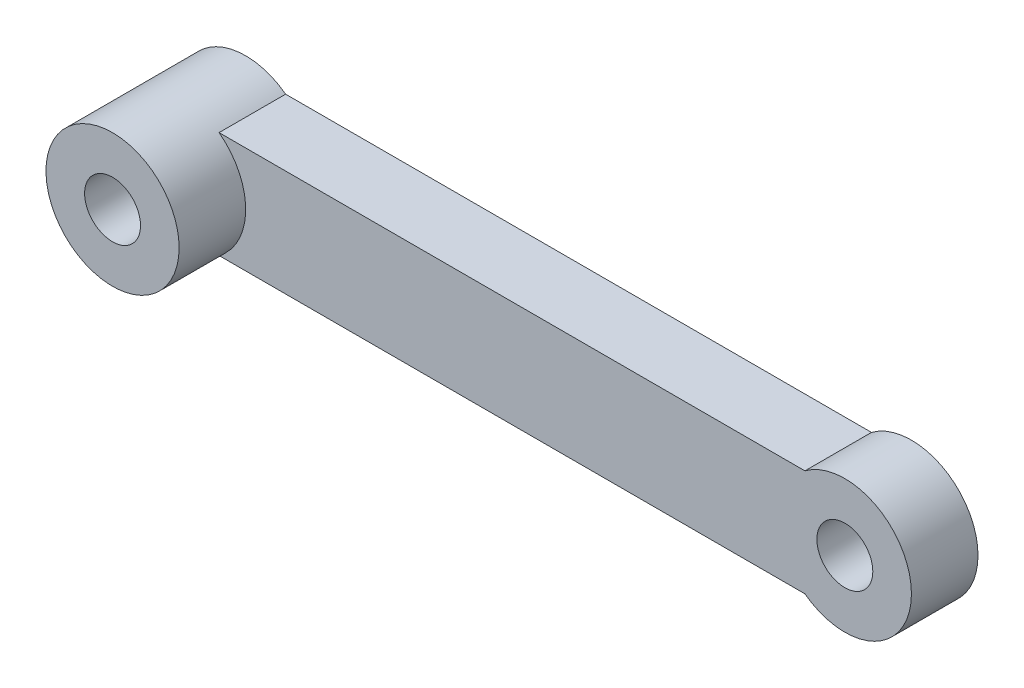
ISO-10303-21;
HEADER;
FILE_DESCRIPTION(('STEP AP214'),'2;1');
FILE_NAME('part.step','',(''),(''),'','','');
FILE_SCHEMA(('AUTOMOTIVE_DESIGN { 1 0 10303 214 1 1 1 1 }'));
ENDSEC;
DATA;
#1=APPLICATION_CONTEXT('core data for automotive mechanical design processes');
#2=APPLICATION_PROTOCOL_DEFINITION('international standard','automotive_design',2000,#1);
#3=PRODUCT_CONTEXT('',#1,'mechanical');
#4=PRODUCT('Part','Part','',(#3));
#5=PRODUCT_RELATED_PRODUCT_CATEGORY('part','',(#4));
#6=PRODUCT_DEFINITION_FORMATION('','',#4);
#7=PRODUCT_DEFINITION_CONTEXT('part definition',#1,'design');
#8=PRODUCT_DEFINITION('design','',#6,#7);
#9=PRODUCT_DEFINITION_SHAPE('','',#8);
#10=(LENGTH_UNIT() NAMED_UNIT(*) SI_UNIT(.MILLI.,.METRE.));
#11=(NAMED_UNIT(*) PLANE_ANGLE_UNIT() SI_UNIT($,.RADIAN.));
#12=(NAMED_UNIT(*) SI_UNIT($,.STERADIAN.) SOLID_ANGLE_UNIT());
#13=UNCERTAINTY_MEASURE_WITH_UNIT(LENGTH_MEASURE(1.E-05),#10,'distance_accuracy_value','');
#14=(GEOMETRIC_REPRESENTATION_CONTEXT(3) GLOBAL_UNCERTAINTY_ASSIGNED_CONTEXT((#13)) GLOBAL_UNIT_ASSIGNED_CONTEXT((#10,
#11,#12)) REPRESENTATION_CONTEXT('',''));
#15=CARTESIAN_POINT('',(0.,0.,0.));
#16=DIRECTION('',(0.,0.,1.));
#17=DIRECTION('',(1.,0.,0.));
#18=AXIS2_PLACEMENT_3D('',#15,#16,#17);
#19=CARTESIAN_POINT('',(-43.0216580109235,-1.7639320225002,5.));
#20=DIRECTION('',(0.,0.,-1.));
#21=DIRECTION('',(-1.,0.,0.));
#22=AXIS2_PLACEMENT_3D('',#19,#20,#21);
#23=CYLINDRICAL_SURFACE('',#22,5.);
#24=CARTESIAN_POINT('',(-43.0216580109235,-1.7639320225002,0.));
#25=DIRECTION('',(0.,0.,1.));
#26=DIRECTION('',(1.,0.,0.));
#27=AXIS2_PLACEMENT_3D('',#24,#25,#26);
#28=CIRCLE('',#27,5.);
#29=CARTESIAN_POINT('',(-40.0216580109235,2.23606797749981,0.));
#30=VERTEX_POINT('',#29);
#31=CARTESIAN_POINT('',(-40.0216580109235,-5.7639320225002,0.));
#32=VERTEX_POINT('',#31);
#33=EDGE_CURVE('E108',#30,#32,#28,.T.);
#34=ORIENTED_EDGE('',*,*,#33,.T.);
#35=DIRECTION('',(0.,0.,-1.));
#36=VECTOR('',#35,1.);
#37=CARTESIAN_POINT('',(-40.0216580109235,-5.7639320225002,5.));
#38=LINE('',#37,#36);
#39=CARTESIAN_POINT('',(-40.0216580109235,-5.7639320225002,5.));
#40=VERTEX_POINT('',#39);
#41=EDGE_CURVE('E51',#40,#32,#38,.T.);
#42=ORIENTED_EDGE('',*,*,#41,.F.);
#43=CARTESIAN_POINT('',(-43.0216580109235,-1.7639320225002,5.));
#44=DIRECTION('',(0.,0.,1.));
#45=DIRECTION('',(1.,0.,0.));
#46=AXIS2_PLACEMENT_3D('',#43,#44,#45);
#47=CIRCLE('',#46,5.);
#48=CARTESIAN_POINT('',(-40.0216580109235,2.23606797749981,5.));
#49=VERTEX_POINT('',#48);
#50=EDGE_CURVE('E11',#40,#49,#47,.T.);
#51=ORIENTED_EDGE('',*,*,#50,.T.);
#52=DIRECTION('',(0.,0.,-1.));
#53=VECTOR('',#52,1.);
#54=CARTESIAN_POINT('',(-40.0216580109235,2.23606797749981,5.));
#55=LINE('',#54,#53);
#56=EDGE_CURVE('E89',#49,#30,#55,.T.);
#57=ORIENTED_EDGE('',*,*,#56,.T.);
#58=EDGE_LOOP('',(#34,#42,#51,#57));
#59=FACE_BOUND('',#58,.T.);
#60=CARTESIAN_POINT('',(-43.0216580109235,-1.7639320225002,10.));
#61=DIRECTION('',(0.,0.,1.));
#62=DIRECTION('',(1.,0.,0.));
#63=AXIS2_PLACEMENT_3D('',#60,#61,#62);
#64=CIRCLE('',#63,5.);
#65=CARTESIAN_POINT('',(-38.0216580109235,-1.7639320225002,10.));
#66=VERTEX_POINT('',#65);
#67=EDGE_CURVE('E139',#66,#66,#64,.T.);
#68=ORIENTED_EDGE('',*,*,#67,.F.);
#69=EDGE_LOOP('',(#68));
#70=FACE_BOUND('',#69,.T.);
#71=ADVANCED_FACE('F47',(#59,#70),#23,.T.);
#72=CARTESIAN_POINT('',(0.,-5.7639320225002,5.));
#73=DIRECTION('',(0.,1.,0.));
#74=DIRECTION('',(-1.,0.,0.));
#75=AXIS2_PLACEMENT_3D('',#72,#73,#74);
#76=PLANE('',#75);
#77=DIRECTION('',(1.,0.,0.));
#78=VECTOR('',#77,1.);
#79=CARTESIAN_POINT('',(0.,-5.7639320225002,0.));
#80=LINE('',#79,#78);
#81=CARTESIAN_POINT('',(3.97834198907648,-5.7639320225002,0.));
#82=VERTEX_POINT('',#81);
#83=EDGE_CURVE('E130',#32,#82,#80,.T.);
#84=ORIENTED_EDGE('',*,*,#83,.T.);
#85=DIRECTION('',(0.,0.,-1.));
#86=VECTOR('',#85,1.);
#87=CARTESIAN_POINT('',(3.97834198907648,-5.7639320225002,5.));
#88=LINE('',#87,#86);
#89=CARTESIAN_POINT('',(3.97834198907648,-5.7639320225002,5.));
#90=VERTEX_POINT('',#89);
#91=EDGE_CURVE('E111',#90,#82,#88,.T.);
#92=ORIENTED_EDGE('',*,*,#91,.F.);
#93=DIRECTION('',(1.,0.,0.));
#94=VECTOR('',#93,1.);
#95=CARTESIAN_POINT('',(0.,-5.7639320225002,5.));
#96=LINE('',#95,#94);
#97=EDGE_CURVE('E124',#40,#90,#96,.T.);
#98=ORIENTED_EDGE('',*,*,#97,.F.);
#99=ORIENTED_EDGE('',*,*,#41,.T.);
#100=EDGE_LOOP('',(#84,#92,#98,#99));
#101=FACE_BOUND('',#100,.T.);
#102=ADVANCED_FACE('F169',(#101),#76,.F.);
#103=CARTESIAN_POINT('',(6.97834198907648,-1.7639320225002,5.));
#104=DIRECTION('',(0.,0.,-1.));
#105=DIRECTION('',(-1.,0.,0.));
#106=AXIS2_PLACEMENT_3D('',#103,#104,#105);
#107=CYLINDRICAL_SURFACE('',#106,5.);
#108=CARTESIAN_POINT('',(6.97834198907648,-1.7639320225002,0.));
#109=DIRECTION('',(0.,0.,1.));
#110=DIRECTION('',(1.,0.,0.));
#111=AXIS2_PLACEMENT_3D('',#108,#109,#110);
#112=CIRCLE('',#111,5.);
#113=CARTESIAN_POINT('',(3.97834198907648,2.23606797749981,0.));
#114=VERTEX_POINT('',#113);
#115=EDGE_CURVE('E127',#82,#114,#112,.T.);
#116=ORIENTED_EDGE('',*,*,#115,.T.);
#117=DIRECTION('',(0.,0.,-1.));
#118=VECTOR('',#117,1.);
#119=CARTESIAN_POINT('',(3.97834198907648,2.23606797749981,5.));
#120=LINE('',#119,#118);
#121=CARTESIAN_POINT('',(3.97834198907648,2.23606797749981,5.));
#122=VERTEX_POINT('',#121);
#123=EDGE_CURVE('E83',#122,#114,#120,.T.);
#124=ORIENTED_EDGE('',*,*,#123,.F.);
#125=CARTESIAN_POINT('',(6.97834198907648,-1.7639320225002,5.));
#126=DIRECTION('',(0.,0.,1.));
#127=DIRECTION('',(1.,0.,0.));
#128=AXIS2_PLACEMENT_3D('',#125,#126,#127);
#129=CIRCLE('',#128,5.);
#130=EDGE_CURVE('E66',#90,#122,#129,.T.);
#131=ORIENTED_EDGE('',*,*,#130,.F.);
#132=ORIENTED_EDGE('',*,*,#91,.T.);
#133=EDGE_LOOP('',(#116,#124,#131,#132));
#134=FACE_BOUND('',#133,.T.);
#135=ADVANCED_FACE('F173',(#134),#107,.T.);
#136=CARTESIAN_POINT('',(0.,2.23606797749981,5.));
#137=DIRECTION('',(0.,1.,0.));
#138=DIRECTION('',(-1.,0.,0.));
#139=AXIS2_PLACEMENT_3D('',#136,#137,#138);
#140=PLANE('',#139);
#141=DIRECTION('',(1.,0.,0.));
#142=VECTOR('',#141,1.);
#143=CARTESIAN_POINT('',(0.,2.23606797749981,0.));
#144=LINE('',#143,#142);
#145=EDGE_CURVE('E102',#30,#114,#144,.T.);
#146=ORIENTED_EDGE('',*,*,#145,.F.);
#147=ORIENTED_EDGE('',*,*,#56,.F.);
#148=DIRECTION('',(1.,0.,0.));
#149=VECTOR('',#148,1.);
#150=CARTESIAN_POINT('',(0.,2.23606797749981,5.));
#151=LINE('',#150,#149);
#152=EDGE_CURVE('E94',#49,#122,#151,.T.);
#153=ORIENTED_EDGE('',*,*,#152,.T.);
#154=ORIENTED_EDGE('',*,*,#123,.T.);
#155=EDGE_LOOP('',(#146,#147,#153,#154));
#156=FACE_BOUND('',#155,.T.);
#157=ADVANCED_FACE('F100',(#156),#140,.T.);
#158=CARTESIAN_POINT('',(-43.0216580109235,-1.7639320225002,5.));
#159=DIRECTION('',(0.,0.,-1.));
#160=DIRECTION('',(-1.,0.,0.));
#161=AXIS2_PLACEMENT_3D('',#158,#159,#160);
#162=CYLINDRICAL_SURFACE('',#161,2.1);
#163=CARTESIAN_POINT('',(-43.0216580109235,-1.7639320225002,0.));
#164=DIRECTION('',(0.,0.,1.));
#165=DIRECTION('',(1.,0.,0.));
#166=AXIS2_PLACEMENT_3D('',#163,#164,#165);
#167=CIRCLE('',#166,2.1);
#168=CARTESIAN_POINT('',(-40.9216580109235,-1.7639320225002,0.));
#169=VERTEX_POINT('',#168);
#170=EDGE_CURVE('E135',#169,#169,#167,.T.);
#171=ORIENTED_EDGE('',*,*,#170,.F.);
#172=EDGE_LOOP('',(#171));
#173=FACE_BOUND('',#172,.T.);
#174=CARTESIAN_POINT('',(-43.0216580109235,-1.7639320225002,10.));
#175=DIRECTION('',(0.,0.,1.));
#176=DIRECTION('',(1.,0.,0.));
#177=AXIS2_PLACEMENT_3D('',#174,#175,#176);
#178=CIRCLE('',#177,2.1);
#179=CARTESIAN_POINT('',(-40.9216580109235,-1.7639320225002,10.));
#180=VERTEX_POINT('',#179);
#181=EDGE_CURVE('E150',#180,#180,#178,.T.);
#182=ORIENTED_EDGE('',*,*,#181,.T.);
#183=EDGE_LOOP('',(#182));
#184=FACE_BOUND('',#183,.T.);
#185=ADVANCED_FACE('F49',(#173,#184),#162,.F.);
#186=CARTESIAN_POINT('',(6.97834198907648,-1.7639320225002,5.));
#187=DIRECTION('',(0.,0.,-1.));
#188=DIRECTION('',(-1.,0.,0.));
#189=AXIS2_PLACEMENT_3D('',#186,#187,#188);
#190=CYLINDRICAL_SURFACE('',#189,2.1);
#191=CARTESIAN_POINT('',(6.97834198907648,-1.7639320225002,5.));
#192=DIRECTION('',(0.,0.,1.));
#193=DIRECTION('',(1.,0.,0.));
#194=AXIS2_PLACEMENT_3D('',#191,#192,#193);
#195=CIRCLE('',#194,2.1);
#196=CARTESIAN_POINT('',(9.07834198907648,-1.7639320225002,5.));
#197=VERTEX_POINT('',#196);
#198=EDGE_CURVE('E98',#197,#197,#195,.T.);
#199=ORIENTED_EDGE('',*,*,#198,.T.);
#200=EDGE_LOOP('',(#199));
#201=FACE_BOUND('',#200,.T.);
#202=CARTESIAN_POINT('',(6.97834198907648,-1.7639320225002,0.));
#203=DIRECTION('',(0.,0.,1.));
#204=DIRECTION('',(1.,0.,0.));
#205=AXIS2_PLACEMENT_3D('',#202,#203,#204);
#206=CIRCLE('',#205,2.1);
#207=CARTESIAN_POINT('',(9.07834198907648,-1.7639320225002,0.));
#208=VERTEX_POINT('',#207);
#209=EDGE_CURVE('E120',#208,#208,#206,.T.);
#210=ORIENTED_EDGE('',*,*,#209,.F.);
#211=EDGE_LOOP('',(#210));
#212=FACE_BOUND('',#211,.T.);
#213=ADVANCED_FACE('F180',(#201,#212),#190,.F.);
#214=CARTESIAN_POINT('',(0.,0.,5.));
#215=DIRECTION('',(0.,0.,1.));
#216=DIRECTION('',(1.,0.,0.));
#217=AXIS2_PLACEMENT_3D('',#214,#215,#216);
#218=PLANE('',#217);
#219=ORIENTED_EDGE('',*,*,#50,.F.);
#220=ORIENTED_EDGE('',*,*,#97,.T.);
#221=ORIENTED_EDGE('',*,*,#130,.T.);
#222=ORIENTED_EDGE('',*,*,#152,.F.);
#223=EDGE_LOOP('',(#219,#220,#221,#222));
#224=FACE_BOUND('',#223,.T.);
#225=ORIENTED_EDGE('',*,*,#198,.F.);
#226=EDGE_LOOP('',(#225));
#227=FACE_BOUND('',#226,.T.);
#228=ADVANCED_FACE('F95',(#224,#227),#218,.T.);
#229=CARTESIAN_POINT('',(0.,0.,0.));
#230=DIRECTION('',(0.,0.,1.));
#231=DIRECTION('',(1.,0.,0.));
#232=AXIS2_PLACEMENT_3D('',#229,#230,#231);
#233=PLANE('',#232);
#234=ORIENTED_EDGE('',*,*,#170,.T.);
#235=EDGE_LOOP('',(#234));
#236=FACE_BOUND('',#235,.T.);
#237=ORIENTED_EDGE('',*,*,#33,.F.);
#238=ORIENTED_EDGE('',*,*,#145,.T.);
#239=ORIENTED_EDGE('',*,*,#115,.F.);
#240=ORIENTED_EDGE('',*,*,#83,.F.);
#241=EDGE_LOOP('',(#237,#238,#239,#240));
#242=FACE_BOUND('',#241,.T.);
#243=ORIENTED_EDGE('',*,*,#209,.T.);
#244=EDGE_LOOP('',(#243));
#245=FACE_BOUND('',#244,.T.);
#246=ADVANCED_FACE('F158',(#236,#242,#245),#233,.F.);
#247=CARTESIAN_POINT('',(-43.0216580109235,-1.7639320225002,10.));
#248=DIRECTION('',(0.,0.,1.));
#249=DIRECTION('',(1.,0.,0.));
#250=AXIS2_PLACEMENT_3D('',#247,#248,#249);
#251=PLANE('',#250);
#252=ORIENTED_EDGE('',*,*,#67,.T.);
#253=EDGE_LOOP('',(#252));
#254=FACE_BOUND('',#253,.T.);
#255=ORIENTED_EDGE('',*,*,#181,.F.);
#256=EDGE_LOOP('',(#255));
#257=FACE_BOUND('',#256,.T.);
#258=ADVANCED_FACE('F156',(#254,#257),#251,.T.);
#259=CLOSED_SHELL('',(#71,#102,#135,#157,#185,#213,#228,#246,#258));
#260=MANIFOLD_SOLID_BREP('B2',#259);
#261=ADVANCED_BREP_SHAPE_REPRESENTATION('',(#18,#260),#14);
#262=SHAPE_DEFINITION_REPRESENTATION(#9,#261);
ENDSEC;
END-ISO-10303-21;
